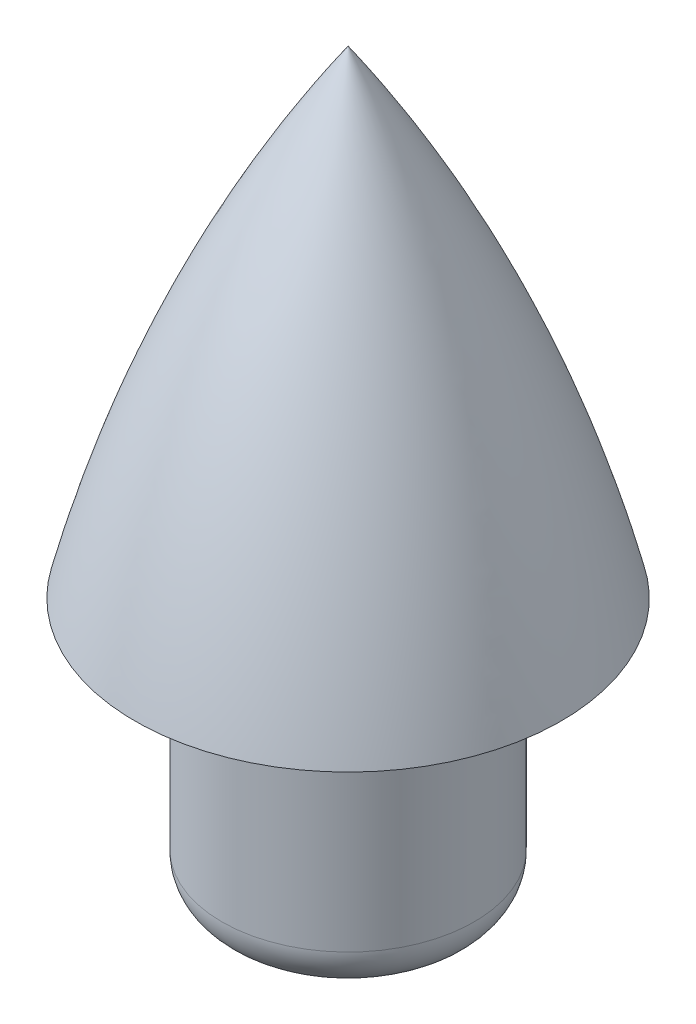
ISO-10303-21;
HEADER;
FILE_DESCRIPTION(('STEP AP214'),'2;1');
FILE_NAME('part.step','',(''),(''),'','','');
FILE_SCHEMA(('AUTOMOTIVE_DESIGN { 1 0 10303 214 1 1 1 1 }'));
ENDSEC;
DATA;
#1=APPLICATION_CONTEXT('core data for automotive mechanical design processes');
#2=APPLICATION_PROTOCOL_DEFINITION('international standard','automotive_design',2000,#1);
#3=PRODUCT_CONTEXT('',#1,'mechanical');
#4=PRODUCT('Part','Part','',(#3));
#5=PRODUCT_RELATED_PRODUCT_CATEGORY('part','',(#4));
#6=PRODUCT_DEFINITION_FORMATION('','',#4);
#7=PRODUCT_DEFINITION_CONTEXT('part definition',#1,'design');
#8=PRODUCT_DEFINITION('design','',#6,#7);
#9=PRODUCT_DEFINITION_SHAPE('','',#8);
#10=(LENGTH_UNIT() NAMED_UNIT(*) SI_UNIT(.MILLI.,.METRE.));
#11=(NAMED_UNIT(*) PLANE_ANGLE_UNIT() SI_UNIT($,.RADIAN.));
#12=(NAMED_UNIT(*) SI_UNIT($,.STERADIAN.) SOLID_ANGLE_UNIT());
#13=UNCERTAINTY_MEASURE_WITH_UNIT(LENGTH_MEASURE(1.E-05),#10,'distance_accuracy_value','');
#14=(GEOMETRIC_REPRESENTATION_CONTEXT(3) GLOBAL_UNCERTAINTY_ASSIGNED_CONTEXT((#13)) GLOBAL_UNIT_ASSIGNED_CONTEXT((#10,
#11,#12)) REPRESENTATION_CONTEXT('',''));
#15=CARTESIAN_POINT('',(0.,0.,0.));
#16=DIRECTION('',(0.,0.,1.));
#17=DIRECTION('',(1.,0.,0.));
#18=AXIS2_PLACEMENT_3D('',#15,#16,#17);
#19=CARTESIAN_POINT('',(0.,30.,0.));
#20=DIRECTION('',(0.,-1.,0.));
#21=DIRECTION('',(0.,0.,-1.));
#22=AXIS2_PLACEMENT_3D('',#19,#20,#21);
#23=CYLINDRICAL_SURFACE('',#22,14.5);
#24=CARTESIAN_POINT('',(0.,5.,0.));
#25=DIRECTION('',(0.,1.,0.));
#26=DIRECTION('',(0.,0.,1.));
#27=AXIS2_PLACEMENT_3D('',#24,#25,#26);
#28=CIRCLE('',#27,14.5);
#29=CARTESIAN_POINT('',(0.,5.,14.5));
#30=VERTEX_POINT('',#29);
#31=EDGE_CURVE('E47',#30,#30,#28,.T.);
#32=ORIENTED_EDGE('',*,*,#31,.T.);
#33=EDGE_LOOP('',(#32));
#34=FACE_BOUND('',#33,.T.);
#35=CARTESIAN_POINT('',(0.,30.,0.));
#36=DIRECTION('',(0.,1.,0.));
#37=DIRECTION('',(0.,0.,1.));
#38=AXIS2_PLACEMENT_3D('',#35,#36,#37);
#39=CIRCLE('',#38,14.5);
#40=CARTESIAN_POINT('',(0.,30.,14.5));
#41=VERTEX_POINT('',#40);
#42=EDGE_CURVE('E60',#41,#41,#39,.T.);
#43=ORIENTED_EDGE('',*,*,#42,.F.);
#44=EDGE_LOOP('',(#43));
#45=FACE_BOUND('',#44,.T.);
#46=ADVANCED_FACE('F39',(#34,#45),#23,.T.);
#47=CARTESIAN_POINT('',(0.,0.,0.));
#48=DIRECTION('',(0.,1.,0.));
#49=DIRECTION('',(0.,0.,1.));
#50=AXIS2_PLACEMENT_3D('',#47,#48,#49);
#51=PLANE('',#50);
#52=CARTESIAN_POINT('',(0.,0.,0.));
#53=DIRECTION('',(0.,1.,0.));
#54=DIRECTION('',(0.,0.,1.));
#55=AXIS2_PLACEMENT_3D('',#52,#53,#54);
#56=CIRCLE('',#55,9.5);
#57=CARTESIAN_POINT('',(0.,0.,9.5));
#58=VERTEX_POINT('',#57);
#59=EDGE_CURVE('E11',#58,#58,#56,.F.);
#60=ORIENTED_EDGE('',*,*,#59,.T.);
#61=EDGE_LOOP('',(#60));
#62=FACE_BOUND('',#61,.T.);
#63=ADVANCED_FACE('F77',(#62),#51,.F.);
#64=CARTESIAN_POINT('',(0.,30.,0.));
#65=DIRECTION('',(0.,-1.,0.));
#66=DIRECTION('',(0.,0.,-1.));
#67=AXIS2_PLACEMENT_3D('',#64,#65,#66);
#68=PLANE('',#67);
#69=ORIENTED_EDGE('',*,*,#42,.T.);
#70=EDGE_LOOP('',(#69));
#71=FACE_BOUND('',#70,.T.);
#72=CARTESIAN_POINT('',(0.,30.,0.));
#73=DIRECTION('',(0.,-1.,0.));
#74=DIRECTION('',(0.,0.,-1.));
#75=AXIS2_PLACEMENT_3D('',#72,#73,#74);
#76=CIRCLE('',#75,24.5);
#77=CARTESIAN_POINT('',(0.,30.,-24.5));
#78=VERTEX_POINT('',#77);
#79=EDGE_CURVE('E57',#78,#78,#76,.T.);
#80=ORIENTED_EDGE('',*,*,#79,.T.);
#81=EDGE_LOOP('',(#80));
#82=FACE_BOUND('',#81,.T.);
#83=ADVANCED_FACE('F53',(#71,#82),#68,.T.);
#84=CARTESIAN_POINT('',(0.,-10.5811932300657,140.585331740964));
#85=DIRECTION('',(-1.,0.,0.));
#86=DIRECTION('',(0.,0.,-1.));
#87=AXIS2_PLACEMENT_3D('',#84,#85,#86);
#88=CIRCLE('',#87,170.);
#89=TRIMMED_CURVE('',#88,(PARAMETER_VALUE(-0.597094780919404)),
(PARAMETER_VALUE(0.597094780919404)),.T.,.PARAMETER.);
#90=CARTESIAN_POINT('',(0.,-10.5811932300657,0.));
#91=DIRECTION('',(0.,-1.,0.));
#92=AXIS1_PLACEMENT('',#90,#91);
#93=SURFACE_OF_REVOLUTION('',#89,#92);
#94=CARTESIAN_POINT('',(0.,85.,0.));
#95=VERTEX_POINT('',#94);
#96=VERTEX_LOOP('',#95);
#97=FACE_BOUND('',#96,.T.);
#98=ORIENTED_EDGE('',*,*,#79,.F.);
#99=EDGE_LOOP('',(#98));
#100=FACE_BOUND('',#99,.T.);
#101=ADVANCED_FACE('F50',(#97,#100),#93,.T.);
#102=CARTESIAN_POINT('',(0.,5.,0.));
#103=DIRECTION('',(0.,1.,0.));
#104=DIRECTION('',(0.,0.,1.));
#105=AXIS2_PLACEMENT_3D('',#102,#103,#104);
#106=TOROIDAL_SURFACE('',#105,9.5,5.);
#107=ORIENTED_EDGE('',*,*,#59,.F.);
#108=EDGE_LOOP('',(#107));
#109=FACE_BOUND('',#108,.T.);
#110=ORIENTED_EDGE('',*,*,#31,.F.);
#111=EDGE_LOOP('',(#110));
#112=FACE_BOUND('',#111,.T.);
#113=ADVANCED_FACE('F41',(#109,#112),#106,.T.);
#114=CLOSED_SHELL('',(#46,#63,#83,#101,#113));
#115=MANIFOLD_SOLID_BREP('B2',#114);
#116=ADVANCED_BREP_SHAPE_REPRESENTATION('',(#18,#115),#14);
#117=SHAPE_DEFINITION_REPRESENTATION(#9,#116);
ENDSEC;
END-ISO-10303-21;
